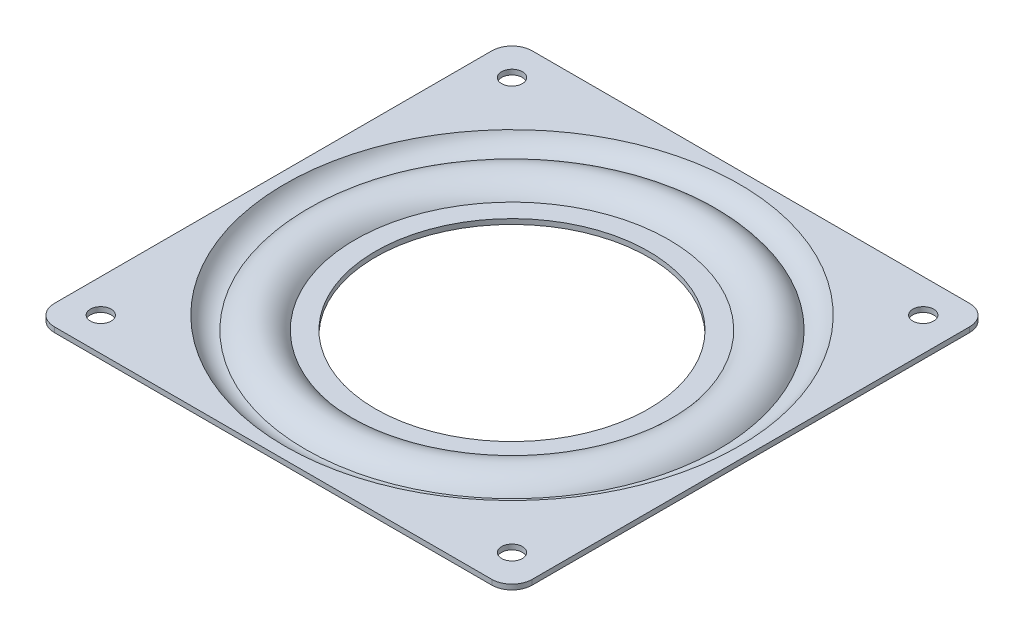
ISO-10303-21;
HEADER;
FILE_DESCRIPTION(('STEP AP214'),'2;1');
FILE_NAME('part.step','',(''),(''),'','','');
FILE_SCHEMA(('AUTOMOTIVE_DESIGN { 1 0 10303 214 1 1 1 1 }'));
ENDSEC;
DATA;
#1=APPLICATION_CONTEXT('core data for automotive mechanical design processes');
#2=APPLICATION_PROTOCOL_DEFINITION('international standard','automotive_design',2000,#1);
#3=PRODUCT_CONTEXT('',#1,'mechanical');
#4=PRODUCT('Part','Part','',(#3));
#5=PRODUCT_RELATED_PRODUCT_CATEGORY('part','',(#4));
#6=PRODUCT_DEFINITION_FORMATION('','',#4);
#7=PRODUCT_DEFINITION_CONTEXT('part definition',#1,'design');
#8=PRODUCT_DEFINITION('design','',#6,#7);
#9=PRODUCT_DEFINITION_SHAPE('','',#8);
#10=(LENGTH_UNIT() NAMED_UNIT(*) SI_UNIT(.MILLI.,.METRE.));
#11=(NAMED_UNIT(*) PLANE_ANGLE_UNIT() SI_UNIT($,.RADIAN.));
#12=(NAMED_UNIT(*) SI_UNIT($,.STERADIAN.) SOLID_ANGLE_UNIT());
#13=UNCERTAINTY_MEASURE_WITH_UNIT(LENGTH_MEASURE(1.E-05),#10,'distance_accuracy_value','');
#14=(GEOMETRIC_REPRESENTATION_CONTEXT(3) GLOBAL_UNCERTAINTY_ASSIGNED_CONTEXT((#13)) GLOBAL_UNIT_ASSIGNED_CONTEXT((#10,
#11,#12)) REPRESENTATION_CONTEXT('',''));
#15=CARTESIAN_POINT('',(0.,0.,0.));
#16=DIRECTION('',(0.,0.,1.));
#17=DIRECTION('',(1.,0.,0.));
#18=AXIS2_PLACEMENT_3D('',#15,#16,#17);
#19=CARTESIAN_POINT('',(0.,1.93021402871017,0.));
#20=DIRECTION('',(0.,1.,0.));
#21=DIRECTION('',(0.,0.,1.));
#22=AXIS2_PLACEMENT_3D('',#19,#20,#21);
#23=TOROIDAL_SURFACE('',#22,40.8455333460894,5.5);
#24=CARTESIAN_POINT('',(0.,-3.5402036630778,0.));
#25=DIRECTION('',(0.,1.,0.));
#26=DIRECTION('',(0.,0.,1.));
#27=AXIS2_PLACEMENT_3D('',#24,#25,#26);
#28=CIRCLE('',#27,40.2758577565007);
#29=CARTESIAN_POINT('',(0.,-3.5402036630778,40.2758577565007));
#30=VERTEX_POINT('',#29);
#31=EDGE_CURVE('E11',#30,#30,#28,.T.);
#32=ORIENTED_EDGE('',*,*,#31,.T.);
#33=EDGE_LOOP('',(#32));
#34=FACE_BOUND('',#33,.T.);
#35=CARTESIAN_POINT('',(0.,-1.,0.));
#36=DIRECTION('',(0.,1.,0.));
#37=DIRECTION('',(0.,0.,1.));
#38=AXIS2_PLACEMENT_3D('',#35,#36,#37);
#39=CIRCLE('',#38,45.4999770019897);
#40=CARTESIAN_POINT('',(0.,-1.,45.4999770019897));
#41=VERTEX_POINT('',#40);
#42=EDGE_CURVE('E44',#41,#41,#39,.F.);
#43=ORIENTED_EDGE('',*,*,#42,.T.);
#44=EDGE_LOOP('',(#43));
#45=FACE_BOUND('',#44,.T.);
#46=ADVANCED_FACE('F41',(#34,#45),#23,.T.);
#47=CARTESIAN_POINT('',(0.,-6.,0.));
#48=DIRECTION('',(0.,1.,0.));
#49=DIRECTION('',(0.,0.,1.));
#50=AXIS2_PLACEMENT_3D('',#47,#48,#49);
#51=TOROIDAL_SURFACE('',#50,35.9227666730447,5.);
#52=CARTESIAN_POINT('',(0.,-3.56978597128984,0.));
#53=DIRECTION('',(0.,1.,0.));
#54=DIRECTION('',(0.,0.,1.));
#55=AXIS2_PLACEMENT_3D('',#52,#53,#54);
#56=CIRCLE('',#55,31.5530916537029);
#57=CARTESIAN_POINT('',(0.,-3.56978597128984,31.5530916537029));
#58=VERTEX_POINT('',#57);
#59=EDGE_CURVE('E51',#58,#58,#56,.T.);
#60=ORIENTED_EDGE('',*,*,#59,.T.);
#61=EDGE_LOOP('',(#60));
#62=FACE_BOUND('',#61,.T.);
#63=ORIENTED_EDGE('',*,*,#31,.F.);
#64=EDGE_LOOP('',(#63));
#65=FACE_BOUND('',#64,.T.);
#66=ADVANCED_FACE('F233',(#62,#65),#51,.F.);
#67=CARTESIAN_POINT('',(0.,-3.56978597128984,0.));
#68=DIRECTION('',(0.,-1.,0.));
#69=DIRECTION('',(0.,0.,-1.));
#70=AXIS2_PLACEMENT_3D('',#67,#68,#69);
#71=PLANE('',#70);
#72=CARTESIAN_POINT('',(0.,-3.56978597128984,0.));
#73=DIRECTION('',(0.,1.,0.));
#74=DIRECTION('',(0.,0.,1.));
#75=AXIS2_PLACEMENT_3D('',#72,#73,#74);
#76=CIRCLE('',#75,27.);
#77=CARTESIAN_POINT('',(0.,-3.56978597128984,27.));
#78=VERTEX_POINT('',#77);
#79=EDGE_CURVE('E225',#78,#78,#76,.T.);
#80=ORIENTED_EDGE('',*,*,#79,.T.);
#81=EDGE_LOOP('',(#80));
#82=FACE_BOUND('',#81,.T.);
#83=ORIENTED_EDGE('',*,*,#59,.F.);
#84=EDGE_LOOP('',(#83));
#85=FACE_BOUND('',#84,.T.);
#86=ADVANCED_FACE('F236',(#82,#85),#71,.T.);
#87=CARTESIAN_POINT('',(0.,6.91716042477171,0.));
#88=DIRECTION('',(0.,1.,0.));
#89=DIRECTION('',(0.,0.,1.));
#90=AXIS2_PLACEMENT_3D('',#87,#88,#89);
#91=CYLINDRICAL_SURFACE('',#90,27.);
#92=ORIENTED_EDGE('',*,*,#79,.F.);
#93=EDGE_LOOP('',(#92));
#94=FACE_BOUND('',#93,.T.);
#95=CARTESIAN_POINT('',(0.,-2.56978597128984,0.));
#96=DIRECTION('',(0.,1.,0.));
#97=DIRECTION('',(0.,0.,1.));
#98=AXIS2_PLACEMENT_3D('',#95,#96,#97);
#99=CIRCLE('',#98,27.);
#100=CARTESIAN_POINT('',(0.,-2.56978597128984,27.));
#101=VERTEX_POINT('',#100);
#102=EDGE_CURVE('E221',#101,#101,#99,.T.);
#103=ORIENTED_EDGE('',*,*,#102,.T.);
#104=EDGE_LOOP('',(#103));
#105=FACE_BOUND('',#104,.T.);
#106=ADVANCED_FACE('F238',(#94,#105),#91,.F.);
#107=CARTESIAN_POINT('',(0.,-2.56978597128984,0.));
#108=DIRECTION('',(0.,-1.,0.));
#109=DIRECTION('',(0.,0.,-1.));
#110=AXIS2_PLACEMENT_3D('',#107,#108,#109);
#111=PLANE('',#110);
#112=ORIENTED_EDGE('',*,*,#102,.F.);
#113=EDGE_LOOP('',(#112));
#114=FACE_BOUND('',#113,.T.);
#115=CARTESIAN_POINT('',(0.,-2.56978597128984,0.));
#116=DIRECTION('',(0.,1.,0.));
#117=DIRECTION('',(0.,0.,1.));
#118=AXIS2_PLACEMENT_3D('',#115,#116,#117);
#119=CIRCLE('',#118,31.);
#120=CARTESIAN_POINT('',(0.,-2.56978597128984,31.));
#121=VERTEX_POINT('',#120);
#122=EDGE_CURVE('E217',#121,#121,#119,.T.);
#123=ORIENTED_EDGE('',*,*,#122,.T.);
#124=EDGE_LOOP('',(#123));
#125=FACE_BOUND('',#124,.T.);
#126=ADVANCED_FACE('F245',(#114,#125),#111,.F.);
#127=CARTESIAN_POINT('',(0.,-6.,0.));
#128=DIRECTION('',(0.,1.,0.));
#129=DIRECTION('',(0.,0.,1.));
#130=AXIS2_PLACEMENT_3D('',#127,#128,#129);
#131=TOROIDAL_SURFACE('',#130,35.9227666730447,6.);
#132=ORIENTED_EDGE('',*,*,#122,.F.);
#133=EDGE_LOOP('',(#132));
#134=FACE_BOUND('',#133,.T.);
#135=CARTESIAN_POINT('',(0.,-2.56978597128983,0.));
#136=DIRECTION('',(0.,1.,0.));
#137=DIRECTION('',(0.,0.,1.));
#138=AXIS2_PLACEMENT_3D('',#135,#136,#137);
#139=CIRCLE('',#138,40.8455333460895);
#140=CARTESIAN_POINT('',(0.,-2.56978597128983,40.8455333460895));
#141=VERTEX_POINT('',#140);
#142=EDGE_CURVE('E213',#141,#141,#139,.T.);
#143=ORIENTED_EDGE('',*,*,#142,.T.);
#144=EDGE_LOOP('',(#143));
#145=FACE_BOUND('',#144,.T.);
#146=ADVANCED_FACE('F347',(#134,#145),#131,.T.);
#147=CARTESIAN_POINT('',(0.,1.93021402871017,0.));
#148=DIRECTION('',(0.,1.,0.));
#149=DIRECTION('',(0.,0.,1.));
#150=AXIS2_PLACEMENT_3D('',#147,#148,#149);
#151=TOROIDAL_SURFACE('',#150,40.8455333460894,4.5);
#152=ORIENTED_EDGE('',*,*,#142,.F.);
#153=EDGE_LOOP('',(#152));
#154=FACE_BOUND('',#153,.T.);
#155=CARTESIAN_POINT('',(0.,0.,0.));
#156=DIRECTION('',(0.,1.,0.));
#157=DIRECTION('',(0.,0.,1.));
#158=AXIS2_PLACEMENT_3D('',#155,#156,#157);
#159=CIRCLE('',#158,44.9105393489596);
#160=CARTESIAN_POINT('',(0.,0.,44.9105393489596));
#161=VERTEX_POINT('',#160);
#162=EDGE_CURVE('E162',#161,#161,#159,.T.);
#163=ORIENTED_EDGE('',*,*,#162,.T.);
#164=EDGE_LOOP('',(#163));
#165=FACE_BOUND('',#164,.T.);
#166=ADVANCED_FACE('F314',(#154,#165),#151,.F.);
#167=CARTESIAN_POINT('',(-47.25,-1.,0.));
#168=DIRECTION('',(-1.,0.,0.));
#169=DIRECTION('',(0.,0.,1.));
#170=AXIS2_PLACEMENT_3D('',#167,#168,#169);
#171=PLANE('',#170);
#172=DIRECTION('',(0.,0.,1.));
#173=VECTOR('',#172,1.);
#174=CARTESIAN_POINT('',(-47.25,0.,0.));
#175=LINE('',#174,#173);
#176=CARTESIAN_POINT('',(-47.25,0.,-43.25));
#177=VERTEX_POINT('',#176);
#178=CARTESIAN_POINT('',(-47.25,0.,43.25));
#179=VERTEX_POINT('',#178);
#180=EDGE_CURVE('E166',#177,#179,#175,.T.);
#181=ORIENTED_EDGE('',*,*,#180,.F.);
#182=DIRECTION('',(0.,1.,0.));
#183=VECTOR('',#182,1.);
#184=CARTESIAN_POINT('',(-47.25,-1.,-43.25));
#185=LINE('',#184,#183);
#186=CARTESIAN_POINT('',(-47.25,-1.,-43.25));
#187=VERTEX_POINT('',#186);
#188=EDGE_CURVE('E59',#187,#177,#185,.T.);
#189=ORIENTED_EDGE('',*,*,#188,.F.);
#190=DIRECTION('',(0.,0.,1.));
#191=VECTOR('',#190,1.);
#192=CARTESIAN_POINT('',(-47.25,-1.,0.));
#193=LINE('',#192,#191);
#194=CARTESIAN_POINT('',(-47.25,-1.,43.25));
#195=VERTEX_POINT('',#194);
#196=EDGE_CURVE('E279',#187,#195,#193,.T.);
#197=ORIENTED_EDGE('',*,*,#196,.T.);
#198=DIRECTION('',(0.,1.,0.));
#199=VECTOR('',#198,1.);
#200=CARTESIAN_POINT('',(-47.25,-1.,43.25));
#201=LINE('',#200,#199);
#202=EDGE_CURVE('E100',#195,#179,#201,.T.);
#203=ORIENTED_EDGE('',*,*,#202,.T.);
#204=EDGE_LOOP('',(#181,#189,#197,#203));
#205=FACE_BOUND('',#204,.T.);
#206=ADVANCED_FACE('F304',(#205),#171,.T.);
#207=CARTESIAN_POINT('',(-43.25,-1.,-43.25));
#208=DIRECTION('',(0.,1.,0.));
#209=DIRECTION('',(0.,0.,1.));
#210=AXIS2_PLACEMENT_3D('',#207,#208,#209);
#211=CYLINDRICAL_SURFACE('',#210,4.);
#212=CARTESIAN_POINT('',(-43.25,0.,-43.25));
#213=DIRECTION('',(0.,1.,0.));
#214=DIRECTION('',(0.,0.,1.));
#215=AXIS2_PLACEMENT_3D('',#212,#213,#214);
#216=CIRCLE('',#215,4.);
#217=CARTESIAN_POINT('',(-43.25,0.,-47.25));
#218=VERTEX_POINT('',#217);
#219=EDGE_CURVE('E191',#218,#177,#216,.T.);
#220=ORIENTED_EDGE('',*,*,#219,.F.);
#221=DIRECTION('',(0.,1.,0.));
#222=VECTOR('',#221,1.);
#223=CARTESIAN_POINT('',(-43.25,-1.,-47.25));
#224=LINE('',#223,#222);
#225=CARTESIAN_POINT('',(-43.25,-1.,-47.25));
#226=VERTEX_POINT('',#225);
#227=EDGE_CURVE('E88',#226,#218,#224,.T.);
#228=ORIENTED_EDGE('',*,*,#227,.F.);
#229=CARTESIAN_POINT('',(-43.25,-1.,-43.25));
#230=DIRECTION('',(0.,1.,0.));
#231=DIRECTION('',(0.,0.,1.));
#232=AXIS2_PLACEMENT_3D('',#229,#230,#231);
#233=CIRCLE('',#232,4.);
#234=EDGE_CURVE('E122',#226,#187,#233,.T.);
#235=ORIENTED_EDGE('',*,*,#234,.T.);
#236=ORIENTED_EDGE('',*,*,#188,.T.);
#237=EDGE_LOOP('',(#220,#228,#235,#236));
#238=FACE_BOUND('',#237,.T.);
#239=ADVANCED_FACE('F306',(#238),#211,.T.);
#240=CARTESIAN_POINT('',(0.,-1.,-47.25));
#241=DIRECTION('',(0.,0.,1.));
#242=DIRECTION('',(1.,0.,0.));
#243=AXIS2_PLACEMENT_3D('',#240,#241,#242);
#244=PLANE('',#243);
#245=DIRECTION('',(1.,0.,0.));
#246=VECTOR('',#245,1.);
#247=CARTESIAN_POINT('',(0.,0.,-47.25));
#248=LINE('',#247,#246);
#249=CARTESIAN_POINT('',(43.25,0.,-47.25));
#250=VERTEX_POINT('',#249);
#251=EDGE_CURVE('E127',#218,#250,#248,.T.);
#252=ORIENTED_EDGE('',*,*,#251,.T.);
#253=DIRECTION('',(0.,1.,0.));
#254=VECTOR('',#253,1.);
#255=CARTESIAN_POINT('',(43.25,-1.,-47.25));
#256=LINE('',#255,#254);
#257=CARTESIAN_POINT('',(43.25,-1.,-47.25));
#258=VERTEX_POINT('',#257);
#259=EDGE_CURVE('E125',#258,#250,#256,.T.);
#260=ORIENTED_EDGE('',*,*,#259,.F.);
#261=DIRECTION('',(1.,0.,0.));
#262=VECTOR('',#261,1.);
#263=CARTESIAN_POINT('',(0.,-1.,-47.25));
#264=LINE('',#263,#262);
#265=EDGE_CURVE('E117',#226,#258,#264,.T.);
#266=ORIENTED_EDGE('',*,*,#265,.F.);
#267=ORIENTED_EDGE('',*,*,#227,.T.);
#268=EDGE_LOOP('',(#252,#260,#266,#267));
#269=FACE_BOUND('',#268,.T.);
#270=ADVANCED_FACE('F126',(#269),#244,.F.);
#271=CARTESIAN_POINT('',(43.25,-1.,-43.25));
#272=DIRECTION('',(0.,1.,0.));
#273=DIRECTION('',(0.,0.,1.));
#274=AXIS2_PLACEMENT_3D('',#271,#272,#273);
#275=CYLINDRICAL_SURFACE('',#274,4.);
#276=CARTESIAN_POINT('',(43.25,0.,-43.25));
#277=DIRECTION('',(0.,1.,0.));
#278=DIRECTION('',(0.,0.,1.));
#279=AXIS2_PLACEMENT_3D('',#276,#277,#278);
#280=CIRCLE('',#279,4.);
#281=CARTESIAN_POINT('',(47.25,0.,-43.25));
#282=VERTEX_POINT('',#281);
#283=EDGE_CURVE('E186',#282,#250,#280,.T.);
#284=ORIENTED_EDGE('',*,*,#283,.F.);
#285=DIRECTION('',(0.,1.,0.));
#286=VECTOR('',#285,1.);
#287=CARTESIAN_POINT('',(47.25,-1.,-43.25));
#288=LINE('',#287,#286);
#289=CARTESIAN_POINT('',(47.25,-1.,-43.25));
#290=VERTEX_POINT('',#289);
#291=EDGE_CURVE('E132',#290,#282,#288,.T.);
#292=ORIENTED_EDGE('',*,*,#291,.F.);
#293=CARTESIAN_POINT('',(43.25,-1.,-43.25));
#294=DIRECTION('',(0.,1.,0.));
#295=DIRECTION('',(0.,0.,1.));
#296=AXIS2_PLACEMENT_3D('',#293,#294,#295);
#297=CIRCLE('',#296,4.);
#298=EDGE_CURVE('E121',#290,#258,#297,.T.);
#299=ORIENTED_EDGE('',*,*,#298,.T.);
#300=ORIENTED_EDGE('',*,*,#259,.T.);
#301=EDGE_LOOP('',(#284,#292,#299,#300));
#302=FACE_BOUND('',#301,.T.);
#303=ADVANCED_FACE('F134',(#302),#275,.T.);
#304=CARTESIAN_POINT('',(47.25,-1.,0.));
#305=DIRECTION('',(-1.,0.,0.));
#306=DIRECTION('',(0.,0.,1.));
#307=AXIS2_PLACEMENT_3D('',#304,#305,#306);
#308=PLANE('',#307);
#309=DIRECTION('',(0.,0.,1.));
#310=VECTOR('',#309,1.);
#311=CARTESIAN_POINT('',(47.25,0.,0.));
#312=LINE('',#311,#310);
#313=CARTESIAN_POINT('',(47.25,0.,43.25));
#314=VERTEX_POINT('',#313);
#315=EDGE_CURVE('E182',#282,#314,#312,.T.);
#316=ORIENTED_EDGE('',*,*,#315,.T.);
#317=DIRECTION('',(0.,1.,0.));
#318=VECTOR('',#317,1.);
#319=CARTESIAN_POINT('',(47.25,-1.,43.25));
#320=LINE('',#319,#318);
#321=CARTESIAN_POINT('',(47.25,-1.,43.25));
#322=VERTEX_POINT('',#321);
#323=EDGE_CURVE('E202',#322,#314,#320,.T.);
#324=ORIENTED_EDGE('',*,*,#323,.F.);
#325=DIRECTION('',(0.,0.,1.));
#326=VECTOR('',#325,1.);
#327=CARTESIAN_POINT('',(47.25,-1.,0.));
#328=LINE('',#327,#326);
#329=EDGE_CURVE('E137',#290,#322,#328,.T.);
#330=ORIENTED_EDGE('',*,*,#329,.F.);
#331=ORIENTED_EDGE('',*,*,#291,.T.);
#332=EDGE_LOOP('',(#316,#324,#330,#331));
#333=FACE_BOUND('',#332,.T.);
#334=ADVANCED_FACE('F320',(#333),#308,.F.);
#335=CARTESIAN_POINT('',(43.25,-1.,43.25));
#336=DIRECTION('',(0.,1.,0.));
#337=DIRECTION('',(0.,0.,1.));
#338=AXIS2_PLACEMENT_3D('',#335,#336,#337);
#339=CYLINDRICAL_SURFACE('',#338,4.);
#340=CARTESIAN_POINT('',(43.25,0.,43.25));
#341=DIRECTION('',(0.,1.,0.));
#342=DIRECTION('',(0.,0.,1.));
#343=AXIS2_PLACEMENT_3D('',#340,#341,#342);
#344=CIRCLE('',#343,4.);
#345=CARTESIAN_POINT('',(43.25,0.,47.25));
#346=VERTEX_POINT('',#345);
#347=EDGE_CURVE('E178',#346,#314,#344,.T.);
#348=ORIENTED_EDGE('',*,*,#347,.F.);
#349=DIRECTION('',(0.,1.,0.));
#350=VECTOR('',#349,1.);
#351=CARTESIAN_POINT('',(43.25,-1.,47.25));
#352=LINE('',#351,#350);
#353=CARTESIAN_POINT('',(43.25,-1.,47.25));
#354=VERTEX_POINT('',#353);
#355=EDGE_CURVE('E205',#354,#346,#352,.T.);
#356=ORIENTED_EDGE('',*,*,#355,.F.);
#357=CARTESIAN_POINT('',(43.25,-1.,43.25));
#358=DIRECTION('',(0.,1.,0.));
#359=DIRECTION('',(0.,0.,1.));
#360=AXIS2_PLACEMENT_3D('',#357,#358,#359);
#361=CIRCLE('',#360,4.);
#362=EDGE_CURVE('E140',#354,#322,#361,.T.);
#363=ORIENTED_EDGE('',*,*,#362,.T.);
#364=ORIENTED_EDGE('',*,*,#323,.T.);
#365=EDGE_LOOP('',(#348,#356,#363,#364));
#366=FACE_BOUND('',#365,.T.);
#367=ADVANCED_FACE('F298',(#366),#339,.T.);
#368=CARTESIAN_POINT('',(0.,-1.,47.25));
#369=DIRECTION('',(0.,0.,1.));
#370=DIRECTION('',(1.,0.,0.));
#371=AXIS2_PLACEMENT_3D('',#368,#369,#370);
#372=PLANE('',#371);
#373=DIRECTION('',(1.,0.,0.));
#374=VECTOR('',#373,1.);
#375=CARTESIAN_POINT('',(0.,0.,47.25));
#376=LINE('',#375,#374);
#377=CARTESIAN_POINT('',(-43.25,0.,47.25));
#378=VERTEX_POINT('',#377);
#379=EDGE_CURVE('E174',#378,#346,#376,.T.);
#380=ORIENTED_EDGE('',*,*,#379,.F.);
#381=DIRECTION('',(0.,1.,0.));
#382=VECTOR('',#381,1.);
#383=CARTESIAN_POINT('',(-43.25,-1.,47.25));
#384=LINE('',#383,#382);
#385=CARTESIAN_POINT('',(-43.25,-1.,47.25));
#386=VERTEX_POINT('',#385);
#387=EDGE_CURVE('E208',#386,#378,#384,.T.);
#388=ORIENTED_EDGE('',*,*,#387,.F.);
#389=DIRECTION('',(1.,0.,0.));
#390=VECTOR('',#389,1.);
#391=CARTESIAN_POINT('',(0.,-1.,47.25));
#392=LINE('',#391,#390);
#393=EDGE_CURVE('E290',#386,#354,#392,.T.);
#394=ORIENTED_EDGE('',*,*,#393,.T.);
#395=ORIENTED_EDGE('',*,*,#355,.T.);
#396=EDGE_LOOP('',(#380,#388,#394,#395));
#397=FACE_BOUND('',#396,.T.);
#398=ADVANCED_FACE('F303',(#397),#372,.T.);
#399=CARTESIAN_POINT('',(-40.6586399182265,-1.,-40.6586399182265));
#400=DIRECTION('',(0.,1.,0.));
#401=DIRECTION('',(0.,0.,1.));
#402=AXIS2_PLACEMENT_3D('',#399,#400,#401);
#403=CYLINDRICAL_SURFACE('',#402,2.05);
#404=CARTESIAN_POINT('',(-40.6586399182265,-1.,-40.6586399182265));
#405=DIRECTION('',(0.,1.,0.));
#406=DIRECTION('',(0.,0.,1.));
#407=AXIS2_PLACEMENT_3D('',#404,#405,#406);
#408=CIRCLE('',#407,2.05);
#409=CARTESIAN_POINT('',(-40.6586399182265,-1.,-38.6086399182265));
#410=VERTEX_POINT('',#409);
#411=EDGE_CURVE('E276',#410,#410,#408,.T.);
#412=ORIENTED_EDGE('',*,*,#411,.F.);
#413=EDGE_LOOP('',(#412));
#414=FACE_BOUND('',#413,.T.);
#415=CARTESIAN_POINT('',(-40.6586399182265,0.,-40.6586399182265));
#416=DIRECTION('',(0.,1.,0.));
#417=DIRECTION('',(0.,0.,1.));
#418=AXIS2_PLACEMENT_3D('',#415,#416,#417);
#419=CIRCLE('',#418,2.05);
#420=CARTESIAN_POINT('',(-40.6586399182265,0.,-38.6086399182265));
#421=VERTEX_POINT('',#420);
#422=EDGE_CURVE('E158',#421,#421,#419,.T.);
#423=ORIENTED_EDGE('',*,*,#422,.T.);
#424=EDGE_LOOP('',(#423));
#425=FACE_BOUND('',#424,.T.);
#426=ADVANCED_FACE('F328',(#414,#425),#403,.F.);
#427=CARTESIAN_POINT('',(40.6586399182289,-1.,-40.6586399182241));
#428=DIRECTION('',(0.,1.,0.));
#429=DIRECTION('',(0.,0.,1.));
#430=AXIS2_PLACEMENT_3D('',#427,#428,#429);
#431=CYLINDRICAL_SURFACE('',#430,2.05);
#432=CARTESIAN_POINT('',(40.6586399182289,-1.,-40.6586399182241));
#433=DIRECTION('',(0.,1.,0.));
#434=DIRECTION('',(0.,0.,1.));
#435=AXIS2_PLACEMENT_3D('',#432,#433,#434);
#436=CIRCLE('',#435,2.05);
#437=CARTESIAN_POINT('',(40.6586399182289,-1.,-38.6086399182241));
#438=VERTEX_POINT('',#437);
#439=EDGE_CURVE('E273',#438,#438,#436,.T.);
#440=ORIENTED_EDGE('',*,*,#439,.F.);
#441=EDGE_LOOP('',(#440));
#442=FACE_BOUND('',#441,.T.);
#443=CARTESIAN_POINT('',(40.6586399182289,0.,-40.6586399182241));
#444=DIRECTION('',(0.,1.,0.));
#445=DIRECTION('',(0.,0.,1.));
#446=AXIS2_PLACEMENT_3D('',#443,#444,#445);
#447=CIRCLE('',#446,2.05);
#448=CARTESIAN_POINT('',(40.6586399182289,0.,-38.6086399182241));
#449=VERTEX_POINT('',#448);
#450=EDGE_CURVE('E154',#449,#449,#447,.T.);
#451=ORIENTED_EDGE('',*,*,#450,.T.);
#452=EDGE_LOOP('',(#451));
#453=FACE_BOUND('',#452,.T.);
#454=ADVANCED_FACE('F334',(#442,#453),#431,.F.);
#455=CARTESIAN_POINT('',(40.6586399182217,-1.,40.6586399182313));
#456=DIRECTION('',(0.,1.,0.));
#457=DIRECTION('',(0.,0.,1.));
#458=AXIS2_PLACEMENT_3D('',#455,#456,#457);
#459=CYLINDRICAL_SURFACE('',#458,2.04999999999999);
#460=CARTESIAN_POINT('',(40.6586399182217,-1.,40.6586399182313));
#461=DIRECTION('',(0.,1.,0.));
#462=DIRECTION('',(0.,0.,1.));
#463=AXIS2_PLACEMENT_3D('',#460,#461,#462);
#464=CIRCLE('',#463,2.04999999999999);
#465=CARTESIAN_POINT('',(40.6586399182217,-1.,42.7086399182313));
#466=VERTEX_POINT('',#465);
#467=EDGE_CURVE('E269',#466,#466,#464,.T.);
#468=ORIENTED_EDGE('',*,*,#467,.F.);
#469=EDGE_LOOP('',(#468));
#470=FACE_BOUND('',#469,.T.);
#471=CARTESIAN_POINT('',(40.6586399182217,0.,40.6586399182313));
#472=DIRECTION('',(0.,1.,0.));
#473=DIRECTION('',(0.,0.,1.));
#474=AXIS2_PLACEMENT_3D('',#471,#472,#473);
#475=CIRCLE('',#474,2.04999999999999);
#476=CARTESIAN_POINT('',(40.6586399182217,0.,42.7086399182313));
#477=VERTEX_POINT('',#476);
#478=EDGE_CURVE('E150',#477,#477,#475,.T.);
#479=ORIENTED_EDGE('',*,*,#478,.T.);
#480=EDGE_LOOP('',(#479));
#481=FACE_BOUND('',#480,.T.);
#482=ADVANCED_FACE('F337',(#470,#481),#459,.F.);
#483=CARTESIAN_POINT('',(-40.6586399182337,-1.,40.6586399182193));
#484=DIRECTION('',(0.,1.,0.));
#485=DIRECTION('',(0.,0.,1.));
#486=AXIS2_PLACEMENT_3D('',#483,#484,#485);
#487=CYLINDRICAL_SURFACE('',#486,2.04999999999999);
#488=CARTESIAN_POINT('',(-40.6586399182337,-1.,40.6586399182193));
#489=DIRECTION('',(0.,1.,0.));
#490=DIRECTION('',(0.,0.,1.));
#491=AXIS2_PLACEMENT_3D('',#488,#489,#490);
#492=CIRCLE('',#491,2.04999999999999);
#493=CARTESIAN_POINT('',(-40.6586399182337,-1.,42.7086399182193));
#494=VERTEX_POINT('',#493);
#495=EDGE_CURVE('E195',#494,#494,#492,.T.);
#496=ORIENTED_EDGE('',*,*,#495,.F.);
#497=EDGE_LOOP('',(#496));
#498=FACE_BOUND('',#497,.T.);
#499=CARTESIAN_POINT('',(-40.6586399182337,0.,40.6586399182193));
#500=DIRECTION('',(0.,1.,0.));
#501=DIRECTION('',(0.,0.,1.));
#502=AXIS2_PLACEMENT_3D('',#499,#500,#501);
#503=CIRCLE('',#502,2.04999999999999);
#504=CARTESIAN_POINT('',(-40.6586399182337,0.,42.7086399182193));
#505=VERTEX_POINT('',#504);
#506=EDGE_CURVE('E146',#505,#505,#503,.T.);
#507=ORIENTED_EDGE('',*,*,#506,.T.);
#508=EDGE_LOOP('',(#507));
#509=FACE_BOUND('',#508,.T.);
#510=ADVANCED_FACE('F330',(#498,#509),#487,.F.);
#511=CARTESIAN_POINT('',(-43.25,-1.,43.25));
#512=DIRECTION('',(0.,1.,0.));
#513=DIRECTION('',(0.,0.,1.));
#514=AXIS2_PLACEMENT_3D('',#511,#512,#513);
#515=CYLINDRICAL_SURFACE('',#514,4.);
#516=CARTESIAN_POINT('',(-43.25,0.,43.25));
#517=DIRECTION('',(0.,1.,0.));
#518=DIRECTION('',(0.,0.,1.));
#519=AXIS2_PLACEMENT_3D('',#516,#517,#518);
#520=CIRCLE('',#519,4.);
#521=EDGE_CURVE('E170',#179,#378,#520,.T.);
#522=ORIENTED_EDGE('',*,*,#521,.F.);
#523=ORIENTED_EDGE('',*,*,#202,.F.);
#524=CARTESIAN_POINT('',(-43.25,-1.,43.25));
#525=DIRECTION('',(0.,1.,0.));
#526=DIRECTION('',(0.,0.,1.));
#527=AXIS2_PLACEMENT_3D('',#524,#525,#526);
#528=CIRCLE('',#527,4.);
#529=EDGE_CURVE('E283',#195,#386,#528,.T.);
#530=ORIENTED_EDGE('',*,*,#529,.T.);
#531=ORIENTED_EDGE('',*,*,#387,.T.);
#532=EDGE_LOOP('',(#522,#523,#530,#531));
#533=FACE_BOUND('',#532,.T.);
#534=ADVANCED_FACE('F261',(#533),#515,.T.);
#535=CARTESIAN_POINT('',(0.,-1.,0.));
#536=DIRECTION('',(0.,1.,0.));
#537=DIRECTION('',(0.,0.,1.));
#538=AXIS2_PLACEMENT_3D('',#535,#536,#537);
#539=PLANE('',#538);
#540=ORIENTED_EDGE('',*,*,#42,.F.);
#541=EDGE_LOOP('',(#540));
#542=FACE_BOUND('',#541,.T.);
#543=ORIENTED_EDGE('',*,*,#495,.T.);
#544=EDGE_LOOP('',(#543));
#545=FACE_BOUND('',#544,.T.);
#546=ORIENTED_EDGE('',*,*,#467,.T.);
#547=EDGE_LOOP('',(#546));
#548=FACE_BOUND('',#547,.T.);
#549=ORIENTED_EDGE('',*,*,#439,.T.);
#550=EDGE_LOOP('',(#549));
#551=FACE_BOUND('',#550,.T.);
#552=ORIENTED_EDGE('',*,*,#411,.T.);
#553=EDGE_LOOP('',(#552));
#554=FACE_BOUND('',#553,.T.);
#555=ORIENTED_EDGE('',*,*,#196,.F.);
#556=ORIENTED_EDGE('',*,*,#234,.F.);
#557=ORIENTED_EDGE('',*,*,#265,.T.);
#558=ORIENTED_EDGE('',*,*,#298,.F.);
#559=ORIENTED_EDGE('',*,*,#329,.T.);
#560=ORIENTED_EDGE('',*,*,#362,.F.);
#561=ORIENTED_EDGE('',*,*,#393,.F.);
#562=ORIENTED_EDGE('',*,*,#529,.F.);
#563=EDGE_LOOP('',(#555,#556,#557,#558,#559,#560,#561,#562));
#564=FACE_BOUND('',#563,.T.);
#565=ADVANCED_FACE('F119',(#542,#545,#548,#551,#554,#564),#539,.F.);
#566=CARTESIAN_POINT('',(0.,0.,0.));
#567=DIRECTION('',(0.,1.,0.));
#568=DIRECTION('',(0.,0.,1.));
#569=AXIS2_PLACEMENT_3D('',#566,#567,#568);
#570=PLANE('',#569);
#571=ORIENTED_EDGE('',*,*,#506,.F.);
#572=EDGE_LOOP('',(#571));
#573=FACE_BOUND('',#572,.T.);
#574=ORIENTED_EDGE('',*,*,#478,.F.);
#575=EDGE_LOOP('',(#574));
#576=FACE_BOUND('',#575,.T.);
#577=ORIENTED_EDGE('',*,*,#450,.F.);
#578=EDGE_LOOP('',(#577));
#579=FACE_BOUND('',#578,.T.);
#580=ORIENTED_EDGE('',*,*,#422,.F.);
#581=EDGE_LOOP('',(#580));
#582=FACE_BOUND('',#581,.T.);
#583=ORIENTED_EDGE('',*,*,#162,.F.);
#584=EDGE_LOOP('',(#583));
#585=FACE_BOUND('',#584,.T.);
#586=ORIENTED_EDGE('',*,*,#180,.T.);
#587=ORIENTED_EDGE('',*,*,#521,.T.);
#588=ORIENTED_EDGE('',*,*,#379,.T.);
#589=ORIENTED_EDGE('',*,*,#347,.T.);
#590=ORIENTED_EDGE('',*,*,#315,.F.);
#591=ORIENTED_EDGE('',*,*,#283,.T.);
#592=ORIENTED_EDGE('',*,*,#251,.F.);
#593=ORIENTED_EDGE('',*,*,#219,.T.);
#594=EDGE_LOOP('',(#586,#587,#588,#589,#590,#591,#592,#593));
#595=FACE_BOUND('',#594,.T.);
#596=ADVANCED_FACE('F260',(#573,#576,#579,#582,#585,#595),#570,.T.);
#597=CLOSED_SHELL('',(#46,#66,#86,#106,#126,#146,#166,#206,#239,#270,#303,#334,#367,#398,#426,
#454,#482,#510,#534,#565,#596));
#598=MANIFOLD_SOLID_BREP('B2',#597);
#599=ADVANCED_BREP_SHAPE_REPRESENTATION('',(#18,#598),#14);
#600=SHAPE_DEFINITION_REPRESENTATION(#9,#599);
ENDSEC;
END-ISO-10303-21;
